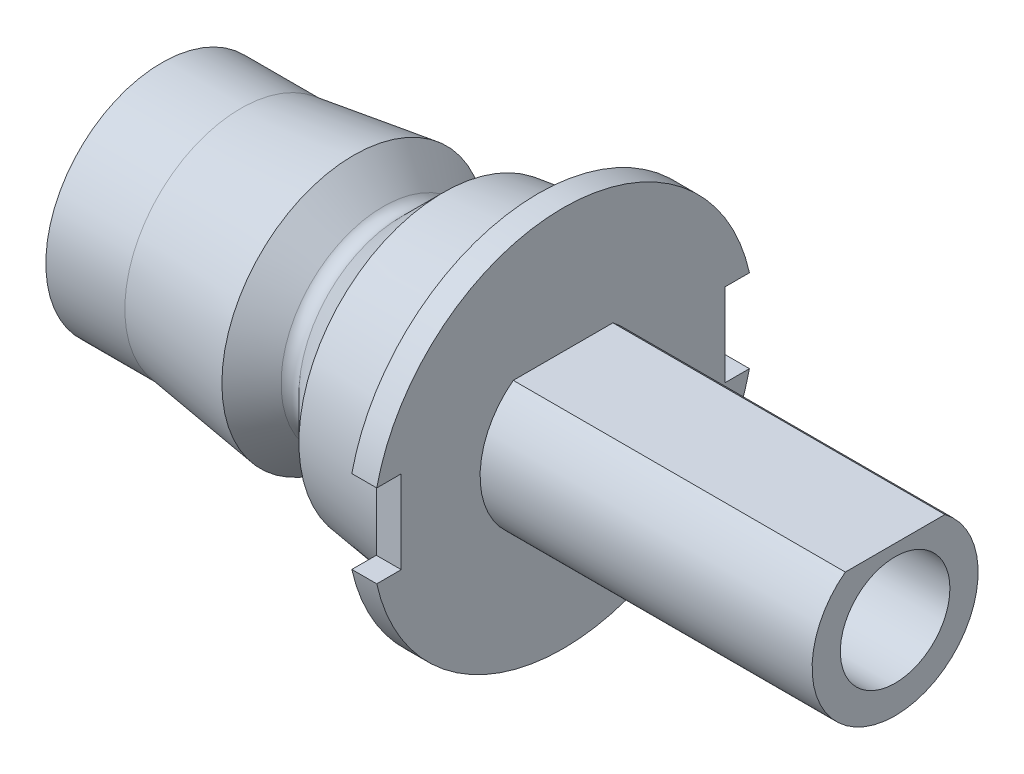
ISO-10303-21;
HEADER;
FILE_DESCRIPTION(('STEP AP214'),'2;1');
FILE_NAME('part.step','',(''),(''),'','','');
FILE_SCHEMA(('AUTOMOTIVE_DESIGN { 1 0 10303 214 1 1 1 1 }'));
ENDSEC;
DATA;
#1=APPLICATION_CONTEXT('core data for automotive mechanical design processes');
#2=APPLICATION_PROTOCOL_DEFINITION('international standard','automotive_design',2000,#1);
#3=PRODUCT_CONTEXT('',#1,'mechanical');
#4=PRODUCT('Part','Part','',(#3));
#5=PRODUCT_RELATED_PRODUCT_CATEGORY('part','',(#4));
#6=PRODUCT_DEFINITION_FORMATION('','',#4);
#7=PRODUCT_DEFINITION_CONTEXT('part definition',#1,'design');
#8=PRODUCT_DEFINITION('design','',#6,#7);
#9=PRODUCT_DEFINITION_SHAPE('','',#8);
#10=(LENGTH_UNIT() NAMED_UNIT(*) SI_UNIT(.MILLI.,.METRE.));
#11=(NAMED_UNIT(*) PLANE_ANGLE_UNIT() SI_UNIT($,.RADIAN.));
#12=(NAMED_UNIT(*) SI_UNIT($,.STERADIAN.) SOLID_ANGLE_UNIT());
#13=UNCERTAINTY_MEASURE_WITH_UNIT(LENGTH_MEASURE(1.E-05),#10,'distance_accuracy_value','');
#14=(GEOMETRIC_REPRESENTATION_CONTEXT(3) GLOBAL_UNCERTAINTY_ASSIGNED_CONTEXT((#13)) GLOBAL_UNIT_ASSIGNED_CONTEXT((#10,
#11,#12)) REPRESENTATION_CONTEXT('',''));
#15=CARTESIAN_POINT('',(0.,0.,0.));
#16=DIRECTION('',(0.,0.,1.));
#17=DIRECTION('',(1.,0.,0.));
#18=AXIS2_PLACEMENT_3D('',#15,#16,#17);
#19=CARTESIAN_POINT('',(24.1765009609634,11.5,0.));
#20=DIRECTION('',(1.,0.,0.));
#21=DIRECTION('',(0.,0.,-1.));
#22=AXIS2_PLACEMENT_3D('',#19,#20,#21);
#23=PLANE('',#22);
#24=DIRECTION('',(0.,0.,1.));
#25=VECTOR('',#24,1.);
#26=CARTESIAN_POINT('',(24.1765009609634,2.5,11.75));
#27=LINE('',#26,#25);
#28=CARTESIAN_POINT('',(24.1765009609634,2.5,9.75));
#29=VERTEX_POINT('',#28);
#30=CARTESIAN_POINT('',(24.1765009609634,2.5,11.2249721603218));
#31=VERTEX_POINT('',#30);
#32=EDGE_CURVE('E130',#29,#31,#27,.T.);
#33=ORIENTED_EDGE('',*,*,#32,.F.);
#34=DIRECTION('',(0.,1.,0.));
#35=VECTOR('',#34,1.);
#36=CARTESIAN_POINT('',(24.1765009609634,2.5,9.75));
#37=LINE('',#36,#35);
#38=CARTESIAN_POINT('',(24.1765009609634,-2.5,9.75));
#39=VERTEX_POINT('',#38);
#40=EDGE_CURVE('E127',#39,#29,#37,.T.);
#41=ORIENTED_EDGE('',*,*,#40,.F.);
#42=DIRECTION('',(0.,0.,-1.));
#43=VECTOR('',#42,1.);
#44=CARTESIAN_POINT('',(24.1765009609634,-2.5,0.));
#45=LINE('',#44,#43);
#46=CARTESIAN_POINT('',(24.1765009609634,-2.50000000000001,11.2249721603218));
#47=VERTEX_POINT('',#46);
#48=EDGE_CURVE('E11',#47,#39,#45,.T.);
#49=ORIENTED_EDGE('',*,*,#48,.F.);
#50=CARTESIAN_POINT('',(24.1765009609634,0.,0.));
#51=DIRECTION('',(1.,0.,0.));
#52=DIRECTION('',(0.,0.,-1.));
#53=AXIS2_PLACEMENT_3D('',#50,#51,#52);
#54=CIRCLE('',#53,11.5);
#55=CARTESIAN_POINT('',(24.1765009609634,-2.5,-11.2249721603218));
#56=VERTEX_POINT('',#55);
#57=EDGE_CURVE('E170',#47,#56,#54,.T.);
#58=ORIENTED_EDGE('',*,*,#57,.T.);
#59=DIRECTION('',(0.,0.,-1.));
#60=VECTOR('',#59,1.);
#61=CARTESIAN_POINT('',(24.1765009609634,-2.5,-9.75));
#62=LINE('',#61,#60);
#63=CARTESIAN_POINT('',(24.1765009609634,-2.5,-9.75));
#64=VERTEX_POINT('',#63);
#65=EDGE_CURVE('E151',#64,#56,#62,.T.);
#66=ORIENTED_EDGE('',*,*,#65,.F.);
#67=DIRECTION('',(0.,-1.,0.));
#68=VECTOR('',#67,1.);
#69=CARTESIAN_POINT('',(24.1765009609634,2.5,-9.75));
#70=LINE('',#69,#68);
#71=CARTESIAN_POINT('',(24.1765009609634,2.5,-9.75));
#72=VERTEX_POINT('',#71);
#73=EDGE_CURVE('E149',#72,#64,#70,.T.);
#74=ORIENTED_EDGE('',*,*,#73,.F.);
#75=DIRECTION('',(0.,0.,1.));
#76=VECTOR('',#75,1.);
#77=CARTESIAN_POINT('',(24.1765009609634,2.5,0.));
#78=LINE('',#77,#76);
#79=CARTESIAN_POINT('',(24.1765009609634,2.5,-11.2249721603218));
#80=VERTEX_POINT('',#79);
#81=EDGE_CURVE('E43',#80,#72,#78,.T.);
#82=ORIENTED_EDGE('',*,*,#81,.F.);
#83=EDGE_CURVE('E171',#80,#31,#54,.T.);
#84=ORIENTED_EDGE('',*,*,#83,.T.);
#85=EDGE_LOOP('',(#33,#41,#49,#58,#66,#74,#82,#84));
#86=FACE_BOUND('',#85,.T.);
#87=DIRECTION('',(0.,0.,1.));
#88=VECTOR('',#87,1.);
#89=CARTESIAN_POINT('',(24.1765009609634,4.,3.));
#90=LINE('',#89,#88);
#91=CARTESIAN_POINT('',(24.1765009609634,4.,-3.));
#92=VERTEX_POINT('',#91);
#93=CARTESIAN_POINT('',(24.1765009609634,4.,3.));
#94=VERTEX_POINT('',#93);
#95=EDGE_CURVE('E124',#92,#94,#90,.T.);
#96=ORIENTED_EDGE('',*,*,#95,.F.);
#97=CARTESIAN_POINT('',(24.1765009609634,0.,0.));
#98=DIRECTION('',(1.,0.,0.));
#99=DIRECTION('',(0.,0.,-1.));
#100=AXIS2_PLACEMENT_3D('',#97,#98,#99);
#101=CIRCLE('',#100,5.);
#102=EDGE_CURVE('E50',#94,#92,#101,.T.);
#103=ORIENTED_EDGE('',*,*,#102,.F.);
#104=EDGE_LOOP('',(#96,#103));
#105=FACE_BOUND('',#104,.T.);
#106=ADVANCED_FACE('F35',(#86,#105),#23,.T.);
#107=CARTESIAN_POINT('',(24.1765009609634,0.,0.));
#108=DIRECTION('',(1.,0.,0.));
#109=DIRECTION('',(0.,0.,-1.));
#110=AXIS2_PLACEMENT_3D('',#107,#108,#109);
#111=CYLINDRICAL_SURFACE('',#110,11.5);
#112=DIRECTION('',(1.,0.,0.));
#113=VECTOR('',#112,1.);
#114=CARTESIAN_POINT('',(24.1765009609634,2.5,11.2249721603218));
#115=LINE('',#114,#113);
#116=CARTESIAN_POINT('',(22.6765009609634,2.5,11.2249721603218));
#117=VERTEX_POINT('',#116);
#118=EDGE_CURVE('E145',#31,#117,#115,.F.);
#119=ORIENTED_EDGE('',*,*,#118,.F.);
#120=ORIENTED_EDGE('',*,*,#83,.F.);
#121=DIRECTION('',(1.,0.,0.));
#122=VECTOR('',#121,1.);
#123=CARTESIAN_POINT('',(24.1765009609634,2.5,-11.2249721603218));
#124=LINE('',#123,#122);
#125=CARTESIAN_POINT('',(22.6765009609634,2.5,-11.2249721603218));
#126=VERTEX_POINT('',#125);
#127=EDGE_CURVE('E164',#126,#80,#124,.T.);
#128=ORIENTED_EDGE('',*,*,#127,.F.);
#129=CARTESIAN_POINT('',(22.6765009609634,0.,0.));
#130=DIRECTION('',(1.,0.,0.));
#131=DIRECTION('',(0.,0.,-1.));
#132=AXIS2_PLACEMENT_3D('',#129,#130,#131);
#133=CIRCLE('',#132,11.5);
#134=EDGE_CURVE('E175',#126,#117,#133,.T.);
#135=ORIENTED_EDGE('',*,*,#134,.T.);
#136=EDGE_LOOP('',(#119,#120,#128,#135));
#137=FACE_BOUND('',#136,.T.);
#138=ADVANCED_FACE('F228',(#137),#111,.T.);
#139=CARTESIAN_POINT('',(0.,0.,0.));
#140=DIRECTION('',(-1.,0.,0.));
#141=DIRECTION('',(0.,0.,1.));
#142=AXIS2_PLACEMENT_3D('',#139,#140,#141);
#143=PLANE('',#142);
#144=CARTESIAN_POINT('',(0.,0.,0.));
#145=DIRECTION('',(1.,0.,0.));
#146=DIRECTION('',(0.,0.,-1.));
#147=AXIS2_PLACEMENT_3D('',#144,#145,#146);
#148=CIRCLE('',#147,3.3);
#149=CARTESIAN_POINT('',(0.,0.,-3.3));
#150=VERTEX_POINT('',#149);
#151=EDGE_CURVE('E284',#150,#150,#148,.T.);
#152=ORIENTED_EDGE('',*,*,#151,.T.);
#153=EDGE_LOOP('',(#152));
#154=FACE_BOUND('',#153,.T.);
#155=CARTESIAN_POINT('',(0.,0.,0.));
#156=DIRECTION('',(1.,0.,0.));
#157=DIRECTION('',(0.,0.,-1.));
#158=AXIS2_PLACEMENT_3D('',#155,#156,#157);
#159=CIRCLE('',#158,6.982);
#160=CARTESIAN_POINT('',(0.,0.,-6.982));
#161=VERTEX_POINT('',#160);
#162=EDGE_CURVE('E196',#161,#161,#159,.T.);
#163=ORIENTED_EDGE('',*,*,#162,.F.);
#164=EDGE_LOOP('',(#163));
#165=FACE_BOUND('',#164,.T.);
#166=ADVANCED_FACE('F37',(#154,#165),#143,.T.);
#167=CARTESIAN_POINT('',(24.1765009609634,0.,0.));
#168=DIRECTION('',(1.,0.,0.));
#169=DIRECTION('',(0.,0.,-1.));
#170=AXIS2_PLACEMENT_3D('',#167,#168,#169);
#171=CYLINDRICAL_SURFACE('',#170,6.982);
#172=ORIENTED_EDGE('',*,*,#162,.T.);
#173=EDGE_LOOP('',(#172));
#174=FACE_BOUND('',#173,.T.);
#175=CARTESIAN_POINT('',(4.76,0.,0.));
#176=DIRECTION('',(1.,0.,0.));
#177=DIRECTION('',(0.,0.,-1.));
#178=AXIS2_PLACEMENT_3D('',#175,#176,#177);
#179=CIRCLE('',#178,6.982);
#180=CARTESIAN_POINT('',(4.76,0.,-6.982));
#181=VERTEX_POINT('',#180);
#182=EDGE_CURVE('E193',#181,#181,#179,.T.);
#183=ORIENTED_EDGE('',*,*,#182,.F.);
#184=EDGE_LOOP('',(#183));
#185=FACE_BOUND('',#184,.T.);
#186=ADVANCED_FACE('F291',(#174,#185),#171,.T.);
#187=CARTESIAN_POINT('',(11.56,0.,0.));
#188=DIRECTION('',(1.,0.,0.));
#189=DIRECTION('',(0.,0.,-1.));
#190=AXIS2_PLACEMENT_3D('',#187,#188,#189);
#191=CONICAL_SURFACE('',#190,7.93767767597627,0.139626340159547);
#192=ORIENTED_EDGE('',*,*,#182,.T.);
#193=EDGE_LOOP('',(#192));
#194=FACE_BOUND('',#193,.T.);
#195=CARTESIAN_POINT('',(11.56,0.,0.));
#196=DIRECTION('',(1.,0.,0.));
#197=DIRECTION('',(0.,0.,-1.));
#198=AXIS2_PLACEMENT_3D('',#195,#196,#197);
#199=CIRCLE('',#198,7.93767767597627);
#200=CARTESIAN_POINT('',(11.56,0.,-7.93767767597627));
#201=VERTEX_POINT('',#200);
#202=EDGE_CURVE('E190',#201,#201,#199,.T.);
#203=ORIENTED_EDGE('',*,*,#202,.F.);
#204=EDGE_LOOP('',(#203));
#205=FACE_BOUND('',#204,.T.);
#206=ADVANCED_FACE('F296',(#194,#205),#191,.T.);
#207=CARTESIAN_POINT('',(13.3431385926017,0.,0.));
#208=DIRECTION('',(-1.,0.,0.));
#209=DIRECTION('',(0.,0.,1.));
#210=AXIS2_PLACEMENT_3D('',#207,#208,#209);
#211=CONICAL_SURFACE('',#210,6.1545390833745,0.785398163397452);
#212=ORIENTED_EDGE('',*,*,#202,.T.);
#213=EDGE_LOOP('',(#212));
#214=FACE_BOUND('',#213,.T.);
#215=CARTESIAN_POINT('',(13.3431385926017,0.,0.));
#216=DIRECTION('',(1.,0.,0.));
#217=DIRECTION('',(0.,0.,-1.));
#218=AXIS2_PLACEMENT_3D('',#215,#216,#217);
#219=CIRCLE('',#218,6.1545390833745);
#220=CARTESIAN_POINT('',(13.3431385926017,0.,-6.1545390833745));
#221=VERTEX_POINT('',#220);
#222=EDGE_CURVE('E187',#221,#221,#219,.T.);
#223=ORIENTED_EDGE('',*,*,#222,.F.);
#224=EDGE_LOOP('',(#223));
#225=FACE_BOUND('',#224,.T.);
#226=ADVANCED_FACE('F301',(#214,#225),#211,.T.);
#227=CARTESIAN_POINT('',(13.8805397463036,0.,0.));
#228=DIRECTION('',(1.,0.,0.));
#229=DIRECTION('',(0.,0.,-1.));
#230=AXIS2_PLACEMENT_3D('',#227,#228,#229);
#231=TOROIDAL_SURFACE('',#230,6.69194023707633,0.76000000000004);
#232=ORIENTED_EDGE('',*,*,#222,.T.);
#233=EDGE_LOOP('',(#232));
#234=FACE_BOUND('',#233,.T.);
#235=CARTESIAN_POINT('',(14.4179409000054,0.,0.));
#236=DIRECTION('',(1.,0.,0.));
#237=DIRECTION('',(0.,0.,-1.));
#238=AXIS2_PLACEMENT_3D('',#235,#236,#237);
#239=CIRCLE('',#238,6.15453908337452);
#240=CARTESIAN_POINT('',(14.4179409000054,0.,-6.15453908337452));
#241=VERTEX_POINT('',#240);
#242=EDGE_CURVE('E184',#241,#241,#239,.T.);
#243=ORIENTED_EDGE('',*,*,#242,.F.);
#244=EDGE_LOOP('',(#243));
#245=FACE_BOUND('',#244,.T.);
#246=ADVANCED_FACE('F307',(#234,#245),#231,.F.);
#247=CARTESIAN_POINT('',(16.96,0.,0.));
#248=DIRECTION('',(1.,0.,0.));
#249=DIRECTION('',(0.,0.,-1.));
#250=AXIS2_PLACEMENT_3D('',#247,#248,#249);
#251=CONICAL_SURFACE('',#250,8.69659818336918,0.785398163397454);
#252=ORIENTED_EDGE('',*,*,#242,.T.);
#253=EDGE_LOOP('',(#252));
#254=FACE_BOUND('',#253,.T.);
#255=CARTESIAN_POINT('',(16.96,0.,0.));
#256=DIRECTION('',(1.,0.,0.));
#257=DIRECTION('',(0.,0.,-1.));
#258=AXIS2_PLACEMENT_3D('',#255,#256,#257);
#259=CIRCLE('',#258,8.69659818336918);
#260=CARTESIAN_POINT('',(16.96,0.,-8.69659818336918));
#261=VERTEX_POINT('',#260);
#262=EDGE_CURVE('E181',#261,#261,#259,.T.);
#263=ORIENTED_EDGE('',*,*,#262,.F.);
#264=EDGE_LOOP('',(#263));
#265=FACE_BOUND('',#264,.T.);
#266=ADVANCED_FACE('F313',(#254,#265),#251,.T.);
#267=CARTESIAN_POINT('',(22.6765009609634,0.,0.));
#268=DIRECTION('',(1.,0.,0.));
#269=DIRECTION('',(0.,0.,-1.));
#270=AXIS2_PLACEMENT_3D('',#267,#268,#269);
#271=CONICAL_SURFACE('',#270,9.5,0.139626340159547);
#272=ORIENTED_EDGE('',*,*,#262,.T.);
#273=EDGE_LOOP('',(#272));
#274=FACE_BOUND('',#273,.T.);
#275=CARTESIAN_POINT('',(22.6765009609634,0.,0.));
#276=DIRECTION('',(1.,0.,0.));
#277=DIRECTION('',(0.,0.,-1.));
#278=AXIS2_PLACEMENT_3D('',#275,#276,#277);
#279=CIRCLE('',#278,9.5);
#280=CARTESIAN_POINT('',(22.6765009609634,0.,-9.5));
#281=VERTEX_POINT('',#280);
#282=EDGE_CURVE('E178',#281,#281,#279,.T.);
#283=ORIENTED_EDGE('',*,*,#282,.F.);
#284=EDGE_LOOP('',(#283));
#285=FACE_BOUND('',#284,.T.);
#286=ADVANCED_FACE('F248',(#274,#285),#271,.T.);
#287=CARTESIAN_POINT('',(22.6765009609634,9.5,0.));
#288=DIRECTION('',(-1.,0.,0.));
#289=DIRECTION('',(0.,0.,1.));
#290=AXIS2_PLACEMENT_3D('',#287,#288,#289);
#291=PLANE('',#290);
#292=DIRECTION('',(0.,0.,-1.));
#293=VECTOR('',#292,1.);
#294=CARTESIAN_POINT('',(22.6765009609634,2.5,0.));
#295=LINE('',#294,#293);
#296=CARTESIAN_POINT('',(22.6765009609634,2.5,9.75));
#297=VERTEX_POINT('',#296);
#298=EDGE_CURVE('E147',#117,#297,#295,.T.);
#299=ORIENTED_EDGE('',*,*,#298,.F.);
#300=ORIENTED_EDGE('',*,*,#134,.F.);
#301=DIRECTION('',(0.,0.,-1.));
#302=VECTOR('',#301,1.);
#303=CARTESIAN_POINT('',(22.6765009609634,2.5,0.));
#304=LINE('',#303,#302);
#305=CARTESIAN_POINT('',(22.6765009609634,2.5,-9.75));
#306=VERTEX_POINT('',#305);
#307=EDGE_CURVE('E166',#306,#126,#304,.T.);
#308=ORIENTED_EDGE('',*,*,#307,.F.);
#309=DIRECTION('',(0.,1.,0.));
#310=VECTOR('',#309,1.);
#311=CARTESIAN_POINT('',(22.6765009609634,9.5,-9.75));
#312=LINE('',#311,#310);
#313=CARTESIAN_POINT('',(22.6765009609634,-2.5,-9.75));
#314=VERTEX_POINT('',#313);
#315=EDGE_CURVE('E168',#314,#306,#312,.T.);
#316=ORIENTED_EDGE('',*,*,#315,.F.);
#317=DIRECTION('',(0.,0.,1.));
#318=VECTOR('',#317,1.);
#319=CARTESIAN_POINT('',(22.6765009609634,-2.5,0.));
#320=LINE('',#319,#318);
#321=CARTESIAN_POINT('',(22.6765009609634,-2.5,-11.2249721603218));
#322=VERTEX_POINT('',#321);
#323=EDGE_CURVE('E162',#322,#314,#320,.T.);
#324=ORIENTED_EDGE('',*,*,#323,.F.);
#325=CARTESIAN_POINT('',(22.6765009609634,-2.5,11.2249721603218));
#326=VERTEX_POINT('',#325);
#327=EDGE_CURVE('E174',#326,#322,#133,.T.);
#328=ORIENTED_EDGE('',*,*,#327,.F.);
#329=DIRECTION('',(0.,0.,1.));
#330=VECTOR('',#329,1.);
#331=CARTESIAN_POINT('',(22.6765009609634,-2.5,0.));
#332=LINE('',#331,#330);
#333=CARTESIAN_POINT('',(22.6765009609634,-2.5,9.75));
#334=VERTEX_POINT('',#333);
#335=EDGE_CURVE('E141',#334,#326,#332,.T.);
#336=ORIENTED_EDGE('',*,*,#335,.F.);
#337=DIRECTION('',(0.,-1.,0.));
#338=VECTOR('',#337,1.);
#339=CARTESIAN_POINT('',(22.6765009609634,9.5,9.75));
#340=LINE('',#339,#338);
#341=EDGE_CURVE('E143',#297,#334,#340,.T.);
#342=ORIENTED_EDGE('',*,*,#341,.F.);
#343=EDGE_LOOP('',(#299,#300,#308,#316,#324,#328,#336,#342));
#344=FACE_BOUND('',#343,.T.);
#345=ORIENTED_EDGE('',*,*,#282,.T.);
#346=EDGE_LOOP('',(#345));
#347=FACE_BOUND('',#346,.T.);
#348=ADVANCED_FACE('F222',(#344,#347),#291,.T.);
#349=DIRECTION('',(1.,0.,0.));
#350=VECTOR('',#349,1.);
#351=CARTESIAN_POINT('',(24.1765009609634,-2.5,11.2249721603218));
#352=LINE('',#351,#350);
#353=EDGE_CURVE('E57',#326,#47,#352,.T.);
#354=ORIENTED_EDGE('',*,*,#353,.F.);
#355=ORIENTED_EDGE('',*,*,#327,.T.);
#356=DIRECTION('',(1.,0.,0.));
#357=VECTOR('',#356,1.);
#358=CARTESIAN_POINT('',(24.1765009609634,-2.5,-11.2249721603218));
#359=LINE('',#358,#357);
#360=EDGE_CURVE('E157',#56,#322,#359,.F.);
#361=ORIENTED_EDGE('',*,*,#360,.F.);
#362=ORIENTED_EDGE('',*,*,#57,.F.);
#363=EDGE_LOOP('',(#354,#355,#361,#362));
#364=FACE_BOUND('',#363,.T.);
#365=ADVANCED_FACE('F240',(#364),#111,.T.);
#366=CARTESIAN_POINT('',(0.,2.5,-9.75));
#367=DIRECTION('',(0.,0.,1.));
#368=DIRECTION('',(1.,0.,0.));
#369=AXIS2_PLACEMENT_3D('',#366,#367,#368);
#370=PLANE('',#369);
#371=ORIENTED_EDGE('',*,*,#315,.T.);
#372=DIRECTION('',(1.,0.,0.));
#373=VECTOR('',#372,1.);
#374=CARTESIAN_POINT('',(0.,2.5,-9.75));
#375=LINE('',#374,#373);
#376=EDGE_CURVE('E155',#306,#72,#375,.T.);
#377=ORIENTED_EDGE('',*,*,#376,.T.);
#378=ORIENTED_EDGE('',*,*,#73,.T.);
#379=DIRECTION('',(1.,0.,0.));
#380=VECTOR('',#379,1.);
#381=CARTESIAN_POINT('',(0.,-2.5,-9.75));
#382=LINE('',#381,#380);
#383=EDGE_CURVE('E154',#314,#64,#382,.T.);
#384=ORIENTED_EDGE('',*,*,#383,.F.);
#385=EDGE_LOOP('',(#371,#377,#378,#384));
#386=FACE_BOUND('',#385,.T.);
#387=ADVANCED_FACE('F213',(#386),#370,.F.);
#388=CARTESIAN_POINT('',(0.,2.5,-9.75));
#389=DIRECTION('',(0.,1.,0.));
#390=DIRECTION('',(0.,0.,1.));
#391=AXIS2_PLACEMENT_3D('',#388,#389,#390);
#392=PLANE('',#391);
#393=ORIENTED_EDGE('',*,*,#307,.T.);
#394=ORIENTED_EDGE('',*,*,#127,.T.);
#395=ORIENTED_EDGE('',*,*,#81,.T.);
#396=ORIENTED_EDGE('',*,*,#376,.F.);
#397=EDGE_LOOP('',(#393,#394,#395,#396));
#398=FACE_BOUND('',#397,.T.);
#399=ADVANCED_FACE('F203',(#398),#392,.F.);
#400=CARTESIAN_POINT('',(0.,-2.5,-9.75));
#401=DIRECTION('',(0.,-1.,0.));
#402=DIRECTION('',(0.,0.,-1.));
#403=AXIS2_PLACEMENT_3D('',#400,#401,#402);
#404=PLANE('',#403);
#405=ORIENTED_EDGE('',*,*,#323,.T.);
#406=ORIENTED_EDGE('',*,*,#383,.T.);
#407=ORIENTED_EDGE('',*,*,#65,.T.);
#408=ORIENTED_EDGE('',*,*,#360,.T.);
#409=EDGE_LOOP('',(#405,#406,#407,#408));
#410=FACE_BOUND('',#409,.T.);
#411=ADVANCED_FACE('F216',(#410),#404,.F.);
#412=CARTESIAN_POINT('',(0.,2.5,11.75));
#413=DIRECTION('',(0.,1.,0.));
#414=DIRECTION('',(0.,0.,1.));
#415=AXIS2_PLACEMENT_3D('',#412,#413,#414);
#416=PLANE('',#415);
#417=ORIENTED_EDGE('',*,*,#298,.T.);
#418=DIRECTION('',(1.,0.,0.));
#419=VECTOR('',#418,1.);
#420=CARTESIAN_POINT('',(0.,2.5,9.75));
#421=LINE('',#420,#419);
#422=EDGE_CURVE('E137',#297,#29,#421,.T.);
#423=ORIENTED_EDGE('',*,*,#422,.T.);
#424=ORIENTED_EDGE('',*,*,#32,.T.);
#425=ORIENTED_EDGE('',*,*,#118,.T.);
#426=EDGE_LOOP('',(#417,#423,#424,#425));
#427=FACE_BOUND('',#426,.T.);
#428=ADVANCED_FACE('F231',(#427),#416,.F.);
#429=CARTESIAN_POINT('',(0.,2.5,9.75));
#430=DIRECTION('',(0.,0.,-1.));
#431=DIRECTION('',(-1.,0.,0.));
#432=AXIS2_PLACEMENT_3D('',#429,#430,#431);
#433=PLANE('',#432);
#434=ORIENTED_EDGE('',*,*,#341,.T.);
#435=DIRECTION('',(1.,0.,0.));
#436=VECTOR('',#435,1.);
#437=CARTESIAN_POINT('',(0.,-2.5,9.75));
#438=LINE('',#437,#436);
#439=EDGE_CURVE('E136',#334,#39,#438,.T.);
#440=ORIENTED_EDGE('',*,*,#439,.T.);
#441=ORIENTED_EDGE('',*,*,#40,.T.);
#442=ORIENTED_EDGE('',*,*,#422,.F.);
#443=EDGE_LOOP('',(#434,#440,#441,#442));
#444=FACE_BOUND('',#443,.T.);
#445=ADVANCED_FACE('F235',(#444),#433,.F.);
#446=CARTESIAN_POINT('',(0.,-2.5,11.75));
#447=DIRECTION('',(0.,-1.,0.));
#448=DIRECTION('',(0.,0.,-1.));
#449=AXIS2_PLACEMENT_3D('',#446,#447,#448);
#450=PLANE('',#449);
#451=ORIENTED_EDGE('',*,*,#335,.T.);
#452=ORIENTED_EDGE('',*,*,#353,.T.);
#453=ORIENTED_EDGE('',*,*,#48,.T.);
#454=ORIENTED_EDGE('',*,*,#439,.F.);
#455=EDGE_LOOP('',(#451,#452,#453,#454));
#456=FACE_BOUND('',#455,.T.);
#457=ADVANCED_FACE('F237',(#456),#450,.F.);
#458=CARTESIAN_POINT('',(44.1765009609634,0.,0.));
#459=DIRECTION('',(-1.,0.,0.));
#460=DIRECTION('',(0.,0.,1.));
#461=AXIS2_PLACEMENT_3D('',#458,#459,#460);
#462=CYLINDRICAL_SURFACE('',#461,5.);
#463=ORIENTED_EDGE('',*,*,#102,.T.);
#464=DIRECTION('',(-1.,0.,0.));
#465=VECTOR('',#464,1.);
#466=CARTESIAN_POINT('',(44.1765009609634,4.,-3.));
#467=LINE('',#466,#465);
#468=CARTESIAN_POINT('',(44.1765009609634,4.,-3.));
#469=VERTEX_POINT('',#468);
#470=EDGE_CURVE('E116',#469,#92,#467,.T.);
#471=ORIENTED_EDGE('',*,*,#470,.F.);
#472=CARTESIAN_POINT('',(44.1765009609634,0.,0.));
#473=DIRECTION('',(1.,0.,0.));
#474=DIRECTION('',(0.,0.,-1.));
#475=AXIS2_PLACEMENT_3D('',#472,#473,#474);
#476=CIRCLE('',#475,5.);
#477=CARTESIAN_POINT('',(44.1765009609634,4.,3.));
#478=VERTEX_POINT('',#477);
#479=EDGE_CURVE('E121',#478,#469,#476,.T.);
#480=ORIENTED_EDGE('',*,*,#479,.F.);
#481=DIRECTION('',(-1.,0.,0.));
#482=VECTOR('',#481,1.);
#483=CARTESIAN_POINT('',(44.1765009609634,4.,3.));
#484=LINE('',#483,#482);
#485=EDGE_CURVE('E118',#478,#94,#484,.T.);
#486=ORIENTED_EDGE('',*,*,#485,.T.);
#487=EDGE_LOOP('',(#463,#471,#480,#486));
#488=FACE_BOUND('',#487,.T.);
#489=ADVANCED_FACE('F126',(#488),#462,.T.);
#490=CARTESIAN_POINT('',(44.1765009609634,4.,3.));
#491=DIRECTION('',(0.,-1.,0.));
#492=DIRECTION('',(0.,0.,-1.));
#493=AXIS2_PLACEMENT_3D('',#490,#491,#492);
#494=PLANE('',#493);
#495=ORIENTED_EDGE('',*,*,#95,.T.);
#496=ORIENTED_EDGE('',*,*,#485,.F.);
#497=DIRECTION('',(0.,0.,1.));
#498=VECTOR('',#497,1.);
#499=CARTESIAN_POINT('',(44.1765009609634,4.,3.));
#500=LINE('',#499,#498);
#501=EDGE_CURVE('E113',#469,#478,#500,.T.);
#502=ORIENTED_EDGE('',*,*,#501,.F.);
#503=ORIENTED_EDGE('',*,*,#470,.T.);
#504=EDGE_LOOP('',(#495,#496,#502,#503));
#505=FACE_BOUND('',#504,.T.);
#506=ADVANCED_FACE('F115',(#505),#494,.F.);
#507=CARTESIAN_POINT('',(44.1765009609634,0.,0.));
#508=DIRECTION('',(1.,0.,0.));
#509=DIRECTION('',(0.,0.,-1.));
#510=AXIS2_PLACEMENT_3D('',#507,#508,#509);
#511=PLANE('',#510);
#512=CARTESIAN_POINT('',(44.1765009609634,0.,0.));
#513=DIRECTION('',(1.,0.,0.));
#514=DIRECTION('',(0.,0.,-1.));
#515=AXIS2_PLACEMENT_3D('',#512,#513,#514);
#516=CIRCLE('',#515,3.3);
#517=CARTESIAN_POINT('',(44.1765009609634,0.,-3.3));
#518=VERTEX_POINT('',#517);
#519=EDGE_CURVE('E281',#518,#518,#516,.T.);
#520=ORIENTED_EDGE('',*,*,#519,.F.);
#521=EDGE_LOOP('',(#520));
#522=FACE_BOUND('',#521,.T.);
#523=ORIENTED_EDGE('',*,*,#479,.T.);
#524=ORIENTED_EDGE('',*,*,#501,.T.);
#525=EDGE_LOOP('',(#523,#524));
#526=FACE_BOUND('',#525,.T.);
#527=ADVANCED_FACE('F123',(#522,#526),#511,.T.);
#528=CARTESIAN_POINT('',(44.1765009609634,0.,0.));
#529=DIRECTION('',(-1.,0.,0.));
#530=DIRECTION('',(0.,0.,1.));
#531=AXIS2_PLACEMENT_3D('',#528,#529,#530);
#532=CYLINDRICAL_SURFACE('',#531,3.3);
#533=ORIENTED_EDGE('',*,*,#519,.T.);
#534=EDGE_LOOP('',(#533));
#535=FACE_BOUND('',#534,.T.);
#536=ORIENTED_EDGE('',*,*,#151,.F.);
#537=EDGE_LOOP('',(#536));
#538=FACE_BOUND('',#537,.T.);
#539=ADVANCED_FACE('F272',(#535,#538),#532,.F.);
#540=CLOSED_SHELL('',(#106,#138,#166,#186,#206,#226,#246,#266,#286,#348,#365,#387,#399,#411,
#428,#445,#457,#489,#506,#527,#539));
#541=MANIFOLD_SOLID_BREP('B2',#540);
#542=ADVANCED_BREP_SHAPE_REPRESENTATION('',(#18,#541),#14);
#543=SHAPE_DEFINITION_REPRESENTATION(#9,#542);
ENDSEC;
END-ISO-10303-21;
